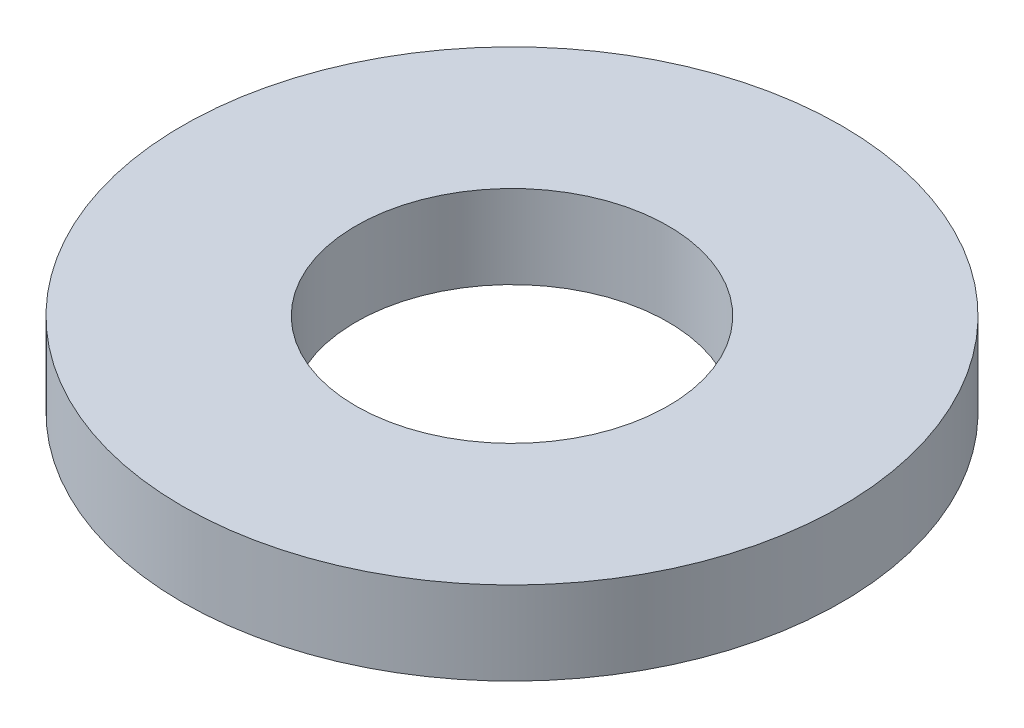
ISO-10303-21;
HEADER;
FILE_DESCRIPTION(('STEP AP214'),'2;1');
FILE_NAME('part.step','',(''),(''),'','','');
FILE_SCHEMA(('AUTOMOTIVE_DESIGN { 1 0 10303 214 1 1 1 1 }'));
ENDSEC;
DATA;
#1=APPLICATION_CONTEXT('core data for automotive mechanical design processes');
#2=APPLICATION_PROTOCOL_DEFINITION('international standard','automotive_design',2000,#1);
#3=PRODUCT_CONTEXT('',#1,'mechanical');
#4=PRODUCT('Part','Part','',(#3));
#5=PRODUCT_RELATED_PRODUCT_CATEGORY('part','',(#4));
#6=PRODUCT_DEFINITION_FORMATION('','',#4);
#7=PRODUCT_DEFINITION_CONTEXT('part definition',#1,'design');
#8=PRODUCT_DEFINITION('design','',#6,#7);
#9=PRODUCT_DEFINITION_SHAPE('','',#8);
#10=(LENGTH_UNIT() NAMED_UNIT(*) SI_UNIT(.MILLI.,.METRE.));
#11=(NAMED_UNIT(*) PLANE_ANGLE_UNIT() SI_UNIT($,.RADIAN.));
#12=(NAMED_UNIT(*) SI_UNIT($,.STERADIAN.) SOLID_ANGLE_UNIT());
#13=UNCERTAINTY_MEASURE_WITH_UNIT(LENGTH_MEASURE(1.E-05),#10,'distance_accuracy_value','');
#14=(GEOMETRIC_REPRESENTATION_CONTEXT(3) GLOBAL_UNCERTAINTY_ASSIGNED_CONTEXT((#13)) GLOBAL_UNIT_ASSIGNED_CONTEXT((#10,
#11,#12)) REPRESENTATION_CONTEXT('',''));
#15=CARTESIAN_POINT('',(0.,0.,0.));
#16=DIRECTION('',(0.,0.,1.));
#17=DIRECTION('',(1.,0.,0.));
#18=AXIS2_PLACEMENT_3D('',#15,#16,#17);
#19=CARTESIAN_POINT('',(0.,24.,0.));
#20=DIRECTION('',(0.,-1.,0.));
#21=DIRECTION('',(0.,0.,-1.));
#22=AXIS2_PLACEMENT_3D('',#19,#20,#21);
#23=CYLINDRICAL_SURFACE('',#22,95.);
#24=CARTESIAN_POINT('',(0.,24.,0.));
#25=DIRECTION('',(0.,1.,0.));
#26=DIRECTION('',(0.,0.,1.));
#27=AXIS2_PLACEMENT_3D('',#24,#25,#26);
#28=CIRCLE('',#27,95.);
#29=CARTESIAN_POINT('',(0.,24.,95.));
#30=VERTEX_POINT('',#29);
#31=EDGE_CURVE('E10',#30,#30,#28,.T.);
#32=ORIENTED_EDGE('',*,*,#31,.F.);
#33=EDGE_LOOP('',(#32));
#34=FACE_BOUND('',#33,.T.);
#35=CARTESIAN_POINT('',(0.,0.,0.));
#36=DIRECTION('',(0.,1.,0.));
#37=DIRECTION('',(0.,0.,1.));
#38=AXIS2_PLACEMENT_3D('',#35,#36,#37);
#39=CIRCLE('',#38,95.);
#40=CARTESIAN_POINT('',(0.,0.,95.));
#41=VERTEX_POINT('',#40);
#42=EDGE_CURVE('E37',#41,#41,#39,.T.);
#43=ORIENTED_EDGE('',*,*,#42,.T.);
#44=EDGE_LOOP('',(#43));
#45=FACE_BOUND('',#44,.T.);
#46=ADVANCED_FACE('F40',(#34,#45),#23,.T.);
#47=CARTESIAN_POINT('',(0.,24.,0.));
#48=DIRECTION('',(0.,1.,0.));
#49=DIRECTION('',(0.,0.,1.));
#50=AXIS2_PLACEMENT_3D('',#47,#48,#49);
#51=PLANE('',#50);
#52=CARTESIAN_POINT('',(0.,24.,0.));
#53=DIRECTION('',(0.,1.,0.));
#54=DIRECTION('',(0.,0.,1.));
#55=AXIS2_PLACEMENT_3D('',#52,#53,#54);
#56=CIRCLE('',#55,45.);
#57=CARTESIAN_POINT('',(0.,24.,45.));
#58=VERTEX_POINT('',#57);
#59=EDGE_CURVE('E50',#58,#58,#56,.T.);
#60=ORIENTED_EDGE('',*,*,#59,.F.);
#61=EDGE_LOOP('',(#60));
#62=FACE_BOUND('',#61,.T.);
#63=ORIENTED_EDGE('',*,*,#31,.T.);
#64=EDGE_LOOP('',(#63));
#65=FACE_BOUND('',#64,.T.);
#66=ADVANCED_FACE('F59',(#62,#65),#51,.T.);
#67=CARTESIAN_POINT('',(0.,0.,0.));
#68=DIRECTION('',(0.,1.,0.));
#69=DIRECTION('',(0.,0.,1.));
#70=AXIS2_PLACEMENT_3D('',#67,#68,#69);
#71=PLANE('',#70);
#72=CARTESIAN_POINT('',(0.,0.,0.));
#73=DIRECTION('',(0.,1.,0.));
#74=DIRECTION('',(0.,0.,1.));
#75=AXIS2_PLACEMENT_3D('',#72,#73,#74);
#76=CIRCLE('',#75,45.);
#77=CARTESIAN_POINT('',(0.,0.,45.));
#78=VERTEX_POINT('',#77);
#79=EDGE_CURVE('E47',#78,#78,#76,.T.);
#80=ORIENTED_EDGE('',*,*,#79,.T.);
#81=EDGE_LOOP('',(#80));
#82=FACE_BOUND('',#81,.T.);
#83=ORIENTED_EDGE('',*,*,#42,.F.);
#84=EDGE_LOOP('',(#83));
#85=FACE_BOUND('',#84,.T.);
#86=ADVANCED_FACE('F58',(#82,#85),#71,.F.);
#87=CARTESIAN_POINT('',(0.,24.,0.));
#88=DIRECTION('',(0.,-1.,0.));
#89=DIRECTION('',(0.,0.,-1.));
#90=AXIS2_PLACEMENT_3D('',#87,#88,#89);
#91=CYLINDRICAL_SURFACE('',#90,45.);
#92=ORIENTED_EDGE('',*,*,#59,.T.);
#93=EDGE_LOOP('',(#92));
#94=FACE_BOUND('',#93,.T.);
#95=ORIENTED_EDGE('',*,*,#79,.F.);
#96=EDGE_LOOP('',(#95));
#97=FACE_BOUND('',#96,.T.);
#98=ADVANCED_FACE('F54',(#94,#97),#91,.F.);
#99=CLOSED_SHELL('',(#46,#66,#86,#98));
#100=MANIFOLD_SOLID_BREP('B2',#99);
#101=ADVANCED_BREP_SHAPE_REPRESENTATION('',(#18,#100),#14);
#102=SHAPE_DEFINITION_REPRESENTATION(#9,#101);
ENDSEC;
END-ISO-10303-21;
